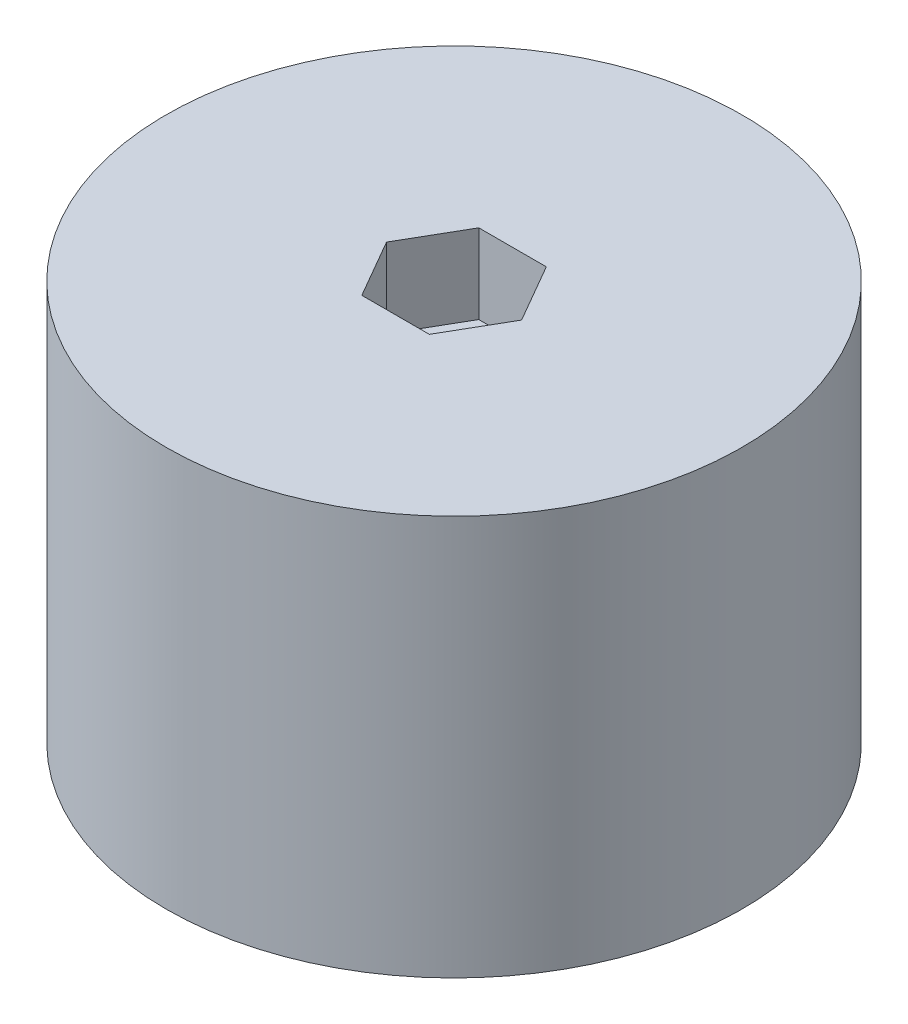
ISO-10303-21;
HEADER;
FILE_DESCRIPTION(('STEP AP214'),'2;1');
FILE_NAME('part.step','',(''),(''),'','','');
FILE_SCHEMA(('AUTOMOTIVE_DESIGN { 1 0 10303 214 1 1 1 1 }'));
ENDSEC;
DATA;
#1=APPLICATION_CONTEXT('core data for automotive mechanical design processes');
#2=APPLICATION_PROTOCOL_DEFINITION('international standard','automotive_design',2000,#1);
#3=PRODUCT_CONTEXT('',#1,'mechanical');
#4=PRODUCT('Part','Part','',(#3));
#5=PRODUCT_RELATED_PRODUCT_CATEGORY('part','',(#4));
#6=PRODUCT_DEFINITION_FORMATION('','',#4);
#7=PRODUCT_DEFINITION_CONTEXT('part definition',#1,'design');
#8=PRODUCT_DEFINITION('design','',#6,#7);
#9=PRODUCT_DEFINITION_SHAPE('','',#8);
#10=(LENGTH_UNIT() NAMED_UNIT(*) SI_UNIT(.MILLI.,.METRE.));
#11=(NAMED_UNIT(*) PLANE_ANGLE_UNIT() SI_UNIT($,.RADIAN.));
#12=(NAMED_UNIT(*) SI_UNIT($,.STERADIAN.) SOLID_ANGLE_UNIT());
#13=UNCERTAINTY_MEASURE_WITH_UNIT(LENGTH_MEASURE(1.E-05),#10,'distance_accuracy_value','');
#14=(GEOMETRIC_REPRESENTATION_CONTEXT(3) GLOBAL_UNCERTAINTY_ASSIGNED_CONTEXT((#13)) GLOBAL_UNIT_ASSIGNED_CONTEXT((#10,
#11,#12)) REPRESENTATION_CONTEXT('',''));
#15=CARTESIAN_POINT('',(0.,0.,0.));
#16=DIRECTION('',(0.,0.,1.));
#17=DIRECTION('',(1.,0.,0.));
#18=AXIS2_PLACEMENT_3D('',#15,#16,#17);
#19=CARTESIAN_POINT('',(0.,30.2,0.));
#20=DIRECTION('',(0.,-1.,0.));
#21=DIRECTION('',(0.,0.,-1.));
#22=AXIS2_PLACEMENT_3D('',#19,#20,#21);
#23=CYLINDRICAL_SURFACE('',#22,3.);
#24=CARTESIAN_POINT('',(0.,0.,0.));
#25=DIRECTION('',(0.,1.,0.));
#26=DIRECTION('',(0.,0.,1.));
#27=AXIS2_PLACEMENT_3D('',#24,#25,#26);
#28=CIRCLE('',#27,3.);
#29=CARTESIAN_POINT('',(0.,0.,3.));
#30=VERTEX_POINT('',#29);
#31=EDGE_CURVE('E165',#30,#30,#28,.T.);
#32=ORIENTED_EDGE('',*,*,#31,.F.);
#33=EDGE_LOOP('',(#32));
#34=FACE_BOUND('',#33,.T.);
#35=CARTESIAN_POINT('',(0.,24.2,0.));
#36=DIRECTION('',(0.,1.,0.));
#37=DIRECTION('',(0.,0.,1.));
#38=AXIS2_PLACEMENT_3D('',#35,#36,#37);
#39=CIRCLE('',#38,3.);
#40=CARTESIAN_POINT('',(0.,24.2,3.));
#41=VERTEX_POINT('',#40);
#42=EDGE_CURVE('E43',#41,#41,#39,.T.);
#43=ORIENTED_EDGE('',*,*,#42,.T.);
#44=EDGE_LOOP('',(#43));
#45=FACE_BOUND('',#44,.T.);
#46=ADVANCED_FACE('F39',(#34,#45),#23,.F.);
#47=CARTESIAN_POINT('',(0.,30.2,0.));
#48=DIRECTION('',(0.,1.,0.));
#49=DIRECTION('',(0.,0.,1.));
#50=AXIS2_PLACEMENT_3D('',#47,#48,#49);
#51=PLANE('',#50);
#52=DIRECTION('',(0.5,0.,-0.866025403784439));
#53=VECTOR('',#52,1.);
#54=CARTESIAN_POINT('',(2.55,30.2,4.41672955930064));
#55=LINE('',#54,#53);
#56=CARTESIAN_POINT('',(2.55,30.2,4.41672955930064));
#57=VERTEX_POINT('',#56);
#58=CARTESIAN_POINT('',(5.1,30.2,0.));
#59=VERTEX_POINT('',#58);
#60=EDGE_CURVE('E57',#57,#59,#55,.T.);
#61=ORIENTED_EDGE('',*,*,#60,.F.);
#62=DIRECTION('',(1.,0.,0.));
#63=VECTOR('',#62,1.);
#64=CARTESIAN_POINT('',(-2.55,30.2,4.41672955930064));
#65=LINE('',#64,#63);
#66=CARTESIAN_POINT('',(-2.55,30.2,4.41672955930064));
#67=VERTEX_POINT('',#66);
#68=EDGE_CURVE('E150',#67,#57,#65,.T.);
#69=ORIENTED_EDGE('',*,*,#68,.F.);
#70=DIRECTION('',(0.5,0.,0.866025403784439));
#71=VECTOR('',#70,1.);
#72=CARTESIAN_POINT('',(-5.1,30.2,0.));
#73=LINE('',#72,#71);
#74=CARTESIAN_POINT('',(-5.1,30.2,0.));
#75=VERTEX_POINT('',#74);
#76=EDGE_CURVE('E147',#75,#67,#73,.T.);
#77=ORIENTED_EDGE('',*,*,#76,.F.);
#78=DIRECTION('',(-0.5,0.,0.866025403784439));
#79=VECTOR('',#78,1.);
#80=CARTESIAN_POINT('',(-2.55,30.2,-4.41672955930064));
#81=LINE('',#80,#79);
#82=CARTESIAN_POINT('',(-2.55,30.2,-4.41672955930064));
#83=VERTEX_POINT('',#82);
#84=EDGE_CURVE('E105',#83,#75,#81,.T.);
#85=ORIENTED_EDGE('',*,*,#84,.F.);
#86=DIRECTION('',(-1.,0.,0.));
#87=VECTOR('',#86,1.);
#88=CARTESIAN_POINT('',(2.55,30.2,-4.41672955930064));
#89=LINE('',#88,#87);
#90=CARTESIAN_POINT('',(2.55,30.2,-4.41672955930064));
#91=VERTEX_POINT('',#90);
#92=EDGE_CURVE('E141',#91,#83,#89,.T.);
#93=ORIENTED_EDGE('',*,*,#92,.F.);
#94=DIRECTION('',(-0.5,0.,-0.866025403784439));
#95=VECTOR('',#94,1.);
#96=CARTESIAN_POINT('',(5.1,30.2,0.));
#97=LINE('',#96,#95);
#98=EDGE_CURVE('E137',#59,#91,#97,.T.);
#99=ORIENTED_EDGE('',*,*,#98,.F.);
#100=EDGE_LOOP('',(#61,#69,#77,#85,#93,#99));
#101=FACE_BOUND('',#100,.T.);
#102=CARTESIAN_POINT('',(0.,30.2,0.));
#103=DIRECTION('',(0.,1.,0.));
#104=DIRECTION('',(0.,0.,1.));
#105=AXIS2_PLACEMENT_3D('',#102,#103,#104);
#106=CIRCLE('',#105,21.75);
#107=CARTESIAN_POINT('',(0.,30.2,21.75));
#108=VERTEX_POINT('',#107);
#109=EDGE_CURVE('E11',#108,#108,#106,.T.);
#110=ORIENTED_EDGE('',*,*,#109,.T.);
#111=EDGE_LOOP('',(#110));
#112=FACE_BOUND('',#111,.T.);
#113=ADVANCED_FACE('F176',(#101,#112),#51,.T.);
#114=CARTESIAN_POINT('',(0.,0.,0.));
#115=DIRECTION('',(0.,1.,0.));
#116=DIRECTION('',(0.,0.,1.));
#117=AXIS2_PLACEMENT_3D('',#114,#115,#116);
#118=PLANE('',#117);
#119=CARTESIAN_POINT('',(0.,0.,0.));
#120=DIRECTION('',(0.,1.,0.));
#121=DIRECTION('',(0.,0.,1.));
#122=AXIS2_PLACEMENT_3D('',#119,#120,#121);
#123=CIRCLE('',#122,21.75);
#124=CARTESIAN_POINT('',(0.,0.,21.75));
#125=VERTEX_POINT('',#124);
#126=EDGE_CURVE('E49',#125,#125,#123,.T.);
#127=ORIENTED_EDGE('',*,*,#126,.F.);
#128=EDGE_LOOP('',(#127));
#129=FACE_BOUND('',#128,.T.);
#130=ORIENTED_EDGE('',*,*,#31,.T.);
#131=EDGE_LOOP('',(#130));
#132=FACE_BOUND('',#131,.T.);
#133=ADVANCED_FACE('F173',(#129,#132),#118,.F.);
#134=CARTESIAN_POINT('',(0.,30.2,0.));
#135=DIRECTION('',(0.,-1.,0.));
#136=DIRECTION('',(0.,0.,-1.));
#137=AXIS2_PLACEMENT_3D('',#134,#135,#136);
#138=CYLINDRICAL_SURFACE('',#137,21.75);
#139=ORIENTED_EDGE('',*,*,#109,.F.);
#140=EDGE_LOOP('',(#139));
#141=FACE_BOUND('',#140,.T.);
#142=ORIENTED_EDGE('',*,*,#126,.T.);
#143=EDGE_LOOP('',(#142));
#144=FACE_BOUND('',#143,.T.);
#145=ADVANCED_FACE('F41',(#141,#144),#138,.T.);
#146=CARTESIAN_POINT('',(2.55,24.2,4.41672955930064));
#147=DIRECTION('',(0.866025403784439,0.,0.5));
#148=DIRECTION('',(0.5,0.,-0.866025403784439));
#149=AXIS2_PLACEMENT_3D('',#146,#147,#148);
#150=PLANE('',#149);
#151=ORIENTED_EDGE('',*,*,#60,.T.);
#152=DIRECTION('',(0.,1.,0.));
#153=VECTOR('',#152,1.);
#154=CARTESIAN_POINT('',(5.1,24.2,0.));
#155=LINE('',#154,#153);
#156=CARTESIAN_POINT('',(5.1,24.2,0.));
#157=VERTEX_POINT('',#156);
#158=EDGE_CURVE('E87',#157,#59,#155,.T.);
#159=ORIENTED_EDGE('',*,*,#158,.F.);
#160=DIRECTION('',(0.5,0.,-0.866025403784439));
#161=VECTOR('',#160,1.);
#162=CARTESIAN_POINT('',(2.55,24.2,4.41672955930064));
#163=LINE('',#162,#161);
#164=CARTESIAN_POINT('',(2.55,24.2,4.41672955930064));
#165=VERTEX_POINT('',#164);
#166=EDGE_CURVE('E153',#165,#157,#163,.T.);
#167=ORIENTED_EDGE('',*,*,#166,.F.);
#168=DIRECTION('',(0.,1.,0.));
#169=VECTOR('',#168,1.);
#170=CARTESIAN_POINT('',(2.55,24.2,4.41672955930064));
#171=LINE('',#170,#169);
#172=EDGE_CURVE('E65',#165,#57,#171,.T.);
#173=ORIENTED_EDGE('',*,*,#172,.T.);
#174=EDGE_LOOP('',(#151,#159,#167,#173));
#175=FACE_BOUND('',#174,.T.);
#176=ADVANCED_FACE('F199',(#175),#150,.F.);
#177=CARTESIAN_POINT('',(-2.55,24.2,4.41672955930064));
#178=DIRECTION('',(0.,0.,1.));
#179=DIRECTION('',(1.,0.,0.));
#180=AXIS2_PLACEMENT_3D('',#177,#178,#179);
#181=PLANE('',#180);
#182=ORIENTED_EDGE('',*,*,#68,.T.);
#183=ORIENTED_EDGE('',*,*,#172,.F.);
#184=DIRECTION('',(1.,0.,0.));
#185=VECTOR('',#184,1.);
#186=CARTESIAN_POINT('',(-2.55,24.2,4.41672955930064));
#187=LINE('',#186,#185);
#188=CARTESIAN_POINT('',(-2.55,24.2,4.41672955930064));
#189=VERTEX_POINT('',#188);
#190=EDGE_CURVE('E119',#189,#165,#187,.T.);
#191=ORIENTED_EDGE('',*,*,#190,.F.);
#192=DIRECTION('',(0.,1.,0.));
#193=VECTOR('',#192,1.);
#194=CARTESIAN_POINT('',(-2.55,24.2,4.41672955930064));
#195=LINE('',#194,#193);
#196=EDGE_CURVE('E110',#189,#67,#195,.T.);
#197=ORIENTED_EDGE('',*,*,#196,.T.);
#198=EDGE_LOOP('',(#182,#183,#191,#197));
#199=FACE_BOUND('',#198,.T.);
#200=ADVANCED_FACE('F196',(#199),#181,.F.);
#201=CARTESIAN_POINT('',(-5.1,24.2,0.));
#202=DIRECTION('',(-0.866025403784439,0.,0.5));
#203=DIRECTION('',(0.5,0.,0.866025403784439));
#204=AXIS2_PLACEMENT_3D('',#201,#202,#203);
#205=PLANE('',#204);
#206=ORIENTED_EDGE('',*,*,#76,.T.);
#207=ORIENTED_EDGE('',*,*,#196,.F.);
#208=DIRECTION('',(0.5,0.,0.866025403784439));
#209=VECTOR('',#208,1.);
#210=CARTESIAN_POINT('',(-5.1,24.2,0.));
#211=LINE('',#210,#209);
#212=CARTESIAN_POINT('',(-5.1,24.2,0.));
#213=VERTEX_POINT('',#212);
#214=EDGE_CURVE('E114',#213,#189,#211,.T.);
#215=ORIENTED_EDGE('',*,*,#214,.F.);
#216=DIRECTION('',(0.,1.,0.));
#217=VECTOR('',#216,1.);
#218=CARTESIAN_POINT('',(-5.1,24.2,0.));
#219=LINE('',#218,#217);
#220=EDGE_CURVE('E98',#213,#75,#219,.T.);
#221=ORIENTED_EDGE('',*,*,#220,.T.);
#222=EDGE_LOOP('',(#206,#207,#215,#221));
#223=FACE_BOUND('',#222,.T.);
#224=ADVANCED_FACE('F115',(#223),#205,.F.);
#225=CARTESIAN_POINT('',(-2.55,24.2,-4.41672955930064));
#226=DIRECTION('',(-0.866025403784439,0.,-0.5));
#227=DIRECTION('',(-0.5,0.,0.866025403784439));
#228=AXIS2_PLACEMENT_3D('',#225,#226,#227);
#229=PLANE('',#228);
#230=ORIENTED_EDGE('',*,*,#84,.T.);
#231=ORIENTED_EDGE('',*,*,#220,.F.);
#232=DIRECTION('',(-0.5,0.,0.866025403784439));
#233=VECTOR('',#232,1.);
#234=CARTESIAN_POINT('',(-2.55,24.2,-4.41672955930064));
#235=LINE('',#234,#233);
#236=CARTESIAN_POINT('',(-2.55,24.2,-4.41672955930064));
#237=VERTEX_POINT('',#236);
#238=EDGE_CURVE('E102',#237,#213,#235,.T.);
#239=ORIENTED_EDGE('',*,*,#238,.F.);
#240=DIRECTION('',(0.,1.,0.));
#241=VECTOR('',#240,1.);
#242=CARTESIAN_POINT('',(-2.55,24.2,-4.41672955930064));
#243=LINE('',#242,#241);
#244=EDGE_CURVE('E111',#237,#83,#243,.T.);
#245=ORIENTED_EDGE('',*,*,#244,.T.);
#246=EDGE_LOOP('',(#230,#231,#239,#245));
#247=FACE_BOUND('',#246,.T.);
#248=ADVANCED_FACE('F100',(#247),#229,.F.);
#249=CARTESIAN_POINT('',(2.55,24.2,-4.41672955930064));
#250=DIRECTION('',(0.,0.,-1.));
#251=DIRECTION('',(-1.,0.,0.));
#252=AXIS2_PLACEMENT_3D('',#249,#250,#251);
#253=PLANE('',#252);
#254=ORIENTED_EDGE('',*,*,#92,.T.);
#255=ORIENTED_EDGE('',*,*,#244,.F.);
#256=DIRECTION('',(-1.,0.,0.));
#257=VECTOR('',#256,1.);
#258=CARTESIAN_POINT('',(2.55,24.2,-4.41672955930064));
#259=LINE('',#258,#257);
#260=CARTESIAN_POINT('',(2.55,24.2,-4.41672955930064));
#261=VERTEX_POINT('',#260);
#262=EDGE_CURVE('E125',#261,#237,#259,.T.);
#263=ORIENTED_EDGE('',*,*,#262,.F.);
#264=DIRECTION('',(0.,1.,0.));
#265=VECTOR('',#264,1.);
#266=CARTESIAN_POINT('',(2.55,24.2,-4.41672955930064));
#267=LINE('',#266,#265);
#268=EDGE_CURVE('E160',#261,#91,#267,.T.);
#269=ORIENTED_EDGE('',*,*,#268,.T.);
#270=EDGE_LOOP('',(#254,#255,#263,#269));
#271=FACE_BOUND('',#270,.T.);
#272=ADVANCED_FACE('F192',(#271),#253,.F.);
#273=CARTESIAN_POINT('',(5.1,24.2,0.));
#274=DIRECTION('',(0.866025403784439,0.,-0.5));
#275=DIRECTION('',(-0.5,0.,-0.866025403784439));
#276=AXIS2_PLACEMENT_3D('',#273,#274,#275);
#277=PLANE('',#276);
#278=ORIENTED_EDGE('',*,*,#98,.T.);
#279=ORIENTED_EDGE('',*,*,#268,.F.);
#280=DIRECTION('',(-0.5,0.,-0.866025403784439));
#281=VECTOR('',#280,1.);
#282=CARTESIAN_POINT('',(5.1,24.2,0.));
#283=LINE('',#282,#281);
#284=EDGE_CURVE('E129',#157,#261,#283,.T.);
#285=ORIENTED_EDGE('',*,*,#284,.F.);
#286=ORIENTED_EDGE('',*,*,#158,.T.);
#287=EDGE_LOOP('',(#278,#279,#285,#286));
#288=FACE_BOUND('',#287,.T.);
#289=ADVANCED_FACE('F187',(#288),#277,.F.);
#290=CARTESIAN_POINT('',(0.,24.2,0.));
#291=DIRECTION('',(0.,1.,0.));
#292=DIRECTION('',(0.,0.,1.));
#293=AXIS2_PLACEMENT_3D('',#290,#291,#292);
#294=PLANE('',#293);
#295=ORIENTED_EDGE('',*,*,#42,.F.);
#296=EDGE_LOOP('',(#295));
#297=FACE_BOUND('',#296,.T.);
#298=ORIENTED_EDGE('',*,*,#166,.T.);
#299=ORIENTED_EDGE('',*,*,#284,.T.);
#300=ORIENTED_EDGE('',*,*,#262,.T.);
#301=ORIENTED_EDGE('',*,*,#238,.T.);
#302=ORIENTED_EDGE('',*,*,#214,.T.);
#303=ORIENTED_EDGE('',*,*,#190,.T.);
#304=EDGE_LOOP('',(#298,#299,#300,#301,#302,#303));
#305=FACE_BOUND('',#304,.T.);
#306=ADVANCED_FACE('F122',(#297,#305),#294,.T.);
#307=CLOSED_SHELL('',(#46,#113,#133,#145,#176,#200,#224,#248,#272,#289,#306));
#308=MANIFOLD_SOLID_BREP('B2',#307);
#309=ADVANCED_BREP_SHAPE_REPRESENTATION('',(#18,#308),#14);
#310=SHAPE_DEFINITION_REPRESENTATION(#9,#309);
ENDSEC;
END-ISO-10303-21;
